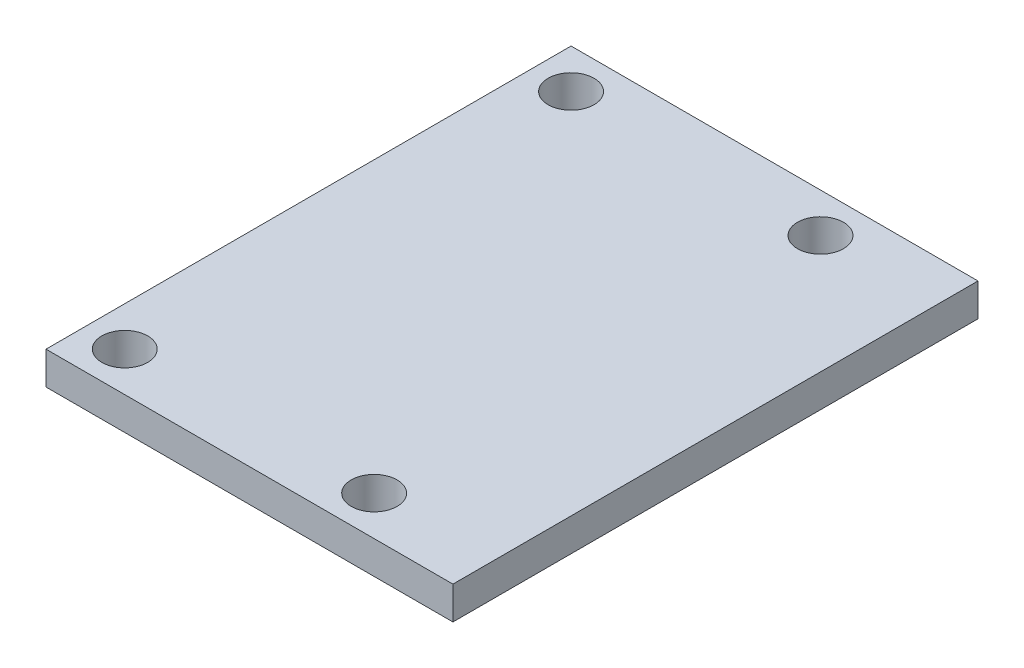
ISO-10303-21;
HEADER;
FILE_DESCRIPTION(('STEP AP214'),'2;1');
FILE_NAME('part.step','',(''),(''),'','','');
FILE_SCHEMA(('AUTOMOTIVE_DESIGN { 1 0 10303 214 1 1 1 1 }'));
ENDSEC;
DATA;
#1=APPLICATION_CONTEXT('core data for automotive mechanical design processes');
#2=APPLICATION_PROTOCOL_DEFINITION('international standard','automotive_design',2000,#1);
#3=PRODUCT_CONTEXT('',#1,'mechanical');
#4=PRODUCT('Part','Part','',(#3));
#5=PRODUCT_RELATED_PRODUCT_CATEGORY('part','',(#4));
#6=PRODUCT_DEFINITION_FORMATION('','',#4);
#7=PRODUCT_DEFINITION_CONTEXT('part definition',#1,'design');
#8=PRODUCT_DEFINITION('design','',#6,#7);
#9=PRODUCT_DEFINITION_SHAPE('','',#8);
#10=(LENGTH_UNIT() NAMED_UNIT(*) SI_UNIT(.MILLI.,.METRE.));
#11=(NAMED_UNIT(*) PLANE_ANGLE_UNIT() SI_UNIT($,.RADIAN.));
#12=(NAMED_UNIT(*) SI_UNIT($,.STERADIAN.) SOLID_ANGLE_UNIT());
#13=UNCERTAINTY_MEASURE_WITH_UNIT(LENGTH_MEASURE(1.E-05),#10,'distance_accuracy_value','');
#14=(GEOMETRIC_REPRESENTATION_CONTEXT(3) GLOBAL_UNCERTAINTY_ASSIGNED_CONTEXT((#13)) GLOBAL_UNIT_ASSIGNED_CONTEXT((#10,
#11,#12)) REPRESENTATION_CONTEXT('',''));
#15=CARTESIAN_POINT('',(0.,0.,0.));
#16=DIRECTION('',(0.,0.,1.));
#17=DIRECTION('',(1.,0.,0.));
#18=AXIS2_PLACEMENT_3D('',#15,#16,#17);
#19=CARTESIAN_POINT('',(-31.,0.,40.));
#20=DIRECTION('',(1.,0.,0.));
#21=DIRECTION('',(0.,1.,0.));
#22=AXIS2_PLACEMENT_3D('',#19,#20,#21);
#23=PLANE('',#22);
#24=DIRECTION('',(0.,-1.,0.));
#25=VECTOR('',#24,1.);
#26=CARTESIAN_POINT('',(-31.,0.,0.));
#27=LINE('',#26,#25);
#28=CARTESIAN_POINT('',(-31.,2.5,0.));
#29=VERTEX_POINT('',#28);
#30=CARTESIAN_POINT('',(-31.,0.,0.));
#31=VERTEX_POINT('',#30);
#32=EDGE_CURVE('E96',#29,#31,#27,.T.);
#33=ORIENTED_EDGE('',*,*,#32,.T.);
#34=DIRECTION('',(0.,0.,-1.));
#35=VECTOR('',#34,1.);
#36=CARTESIAN_POINT('',(-31.,0.,40.));
#37=LINE('',#36,#35);
#38=CARTESIAN_POINT('',(-31.,0.,40.));
#39=VERTEX_POINT('',#38);
#40=EDGE_CURVE('E11',#39,#31,#37,.T.);
#41=ORIENTED_EDGE('',*,*,#40,.F.);
#42=DIRECTION('',(0.,-1.,0.));
#43=VECTOR('',#42,1.);
#44=CARTESIAN_POINT('',(-31.,0.,40.));
#45=LINE('',#44,#43);
#46=CARTESIAN_POINT('',(-31.,2.5,40.));
#47=VERTEX_POINT('',#46);
#48=EDGE_CURVE('E82',#47,#39,#45,.T.);
#49=ORIENTED_EDGE('',*,*,#48,.F.);
#50=DIRECTION('',(0.,0.,-1.));
#51=VECTOR('',#50,1.);
#52=CARTESIAN_POINT('',(-31.,2.5,40.));
#53=LINE('',#52,#51);
#54=EDGE_CURVE('E92',#47,#29,#53,.T.);
#55=ORIENTED_EDGE('',*,*,#54,.T.);
#56=EDGE_LOOP('',(#33,#41,#49,#55));
#57=FACE_BOUND('',#56,.T.);
#58=ADVANCED_FACE('F32',(#57),#23,.F.);
#59=CARTESIAN_POINT('',(0.,0.,40.));
#60=DIRECTION('',(0.,1.,0.));
#61=DIRECTION('',(-1.,0.,0.));
#62=AXIS2_PLACEMENT_3D('',#59,#60,#61);
#63=PLANE('',#62);
#64=CARTESIAN_POINT('',(-9.,0.,37.));
#65=DIRECTION('',(0.,1.,0.));
#66=DIRECTION('',(-1.,0.,0.));
#67=AXIS2_PLACEMENT_3D('',#64,#65,#66);
#68=CIRCLE('',#67,1.75);
#69=CARTESIAN_POINT('',(-10.75,0.,37.));
#70=VERTEX_POINT('',#69);
#71=EDGE_CURVE('E125',#70,#70,#68,.F.);
#72=ORIENTED_EDGE('',*,*,#71,.F.);
#73=EDGE_LOOP('',(#72));
#74=FACE_BOUND('',#73,.T.);
#75=CARTESIAN_POINT('',(-28.,0.,37.));
#76=DIRECTION('',(0.,1.,0.));
#77=DIRECTION('',(-1.,0.,0.));
#78=AXIS2_PLACEMENT_3D('',#75,#76,#77);
#79=CIRCLE('',#78,1.75);
#80=CARTESIAN_POINT('',(-29.75,0.,37.));
#81=VERTEX_POINT('',#80);
#82=EDGE_CURVE('E119',#81,#81,#79,.F.);
#83=ORIENTED_EDGE('',*,*,#82,.F.);
#84=EDGE_LOOP('',(#83));
#85=FACE_BOUND('',#84,.T.);
#86=CARTESIAN_POINT('',(-28.,0.,3.));
#87=DIRECTION('',(0.,1.,0.));
#88=DIRECTION('',(-1.,0.,0.));
#89=AXIS2_PLACEMENT_3D('',#86,#87,#88);
#90=CIRCLE('',#89,1.75);
#91=CARTESIAN_POINT('',(-29.75,0.,3.));
#92=VERTEX_POINT('',#91);
#93=EDGE_CURVE('E113',#92,#92,#90,.F.);
#94=ORIENTED_EDGE('',*,*,#93,.F.);
#95=EDGE_LOOP('',(#94));
#96=FACE_BOUND('',#95,.T.);
#97=CARTESIAN_POINT('',(-9.,0.,3.));
#98=DIRECTION('',(0.,1.,0.));
#99=DIRECTION('',(-1.,0.,0.));
#100=AXIS2_PLACEMENT_3D('',#97,#98,#99);
#101=CIRCLE('',#100,1.75);
#102=CARTESIAN_POINT('',(-10.75,0.,3.));
#103=VERTEX_POINT('',#102);
#104=EDGE_CURVE('E99',#103,#103,#101,.F.);
#105=ORIENTED_EDGE('',*,*,#104,.F.);
#106=EDGE_LOOP('',(#105));
#107=FACE_BOUND('',#106,.T.);
#108=DIRECTION('',(1.,0.,0.));
#109=VECTOR('',#108,1.);
#110=CARTESIAN_POINT('',(0.,0.,0.));
#111=LINE('',#110,#109);
#112=CARTESIAN_POINT('',(0.,0.,0.));
#113=VERTEX_POINT('',#112);
#114=EDGE_CURVE('E87',#31,#113,#111,.T.);
#115=ORIENTED_EDGE('',*,*,#114,.T.);
#116=DIRECTION('',(0.,0.,-1.));
#117=VECTOR('',#116,1.);
#118=CARTESIAN_POINT('',(0.,0.,40.));
#119=LINE('',#118,#117);
#120=CARTESIAN_POINT('',(0.,0.,40.));
#121=VERTEX_POINT('',#120);
#122=EDGE_CURVE('E40',#121,#113,#119,.T.);
#123=ORIENTED_EDGE('',*,*,#122,.F.);
#124=DIRECTION('',(1.,0.,0.));
#125=VECTOR('',#124,1.);
#126=CARTESIAN_POINT('',(0.,0.,40.));
#127=LINE('',#126,#125);
#128=EDGE_CURVE('E76',#39,#121,#127,.T.);
#129=ORIENTED_EDGE('',*,*,#128,.F.);
#130=ORIENTED_EDGE('',*,*,#40,.T.);
#131=EDGE_LOOP('',(#115,#123,#129,#130));
#132=FACE_BOUND('',#131,.T.);
#133=ADVANCED_FACE('F86',(#74,#85,#96,#107,#132),#63,.F.);
#134=CARTESIAN_POINT('',(0.,2.5,40.));
#135=DIRECTION('',(-1.,0.,0.));
#136=DIRECTION('',(0.,0.,1.));
#137=AXIS2_PLACEMENT_3D('',#134,#135,#136);
#138=PLANE('',#137);
#139=DIRECTION('',(0.,1.,0.));
#140=VECTOR('',#139,1.);
#141=CARTESIAN_POINT('',(0.,2.5,0.));
#142=LINE('',#141,#140);
#143=CARTESIAN_POINT('',(0.,2.5,0.));
#144=VERTEX_POINT('',#143);
#145=EDGE_CURVE('E101',#113,#144,#142,.T.);
#146=ORIENTED_EDGE('',*,*,#145,.T.);
#147=DIRECTION('',(0.,0.,-1.));
#148=VECTOR('',#147,1.);
#149=CARTESIAN_POINT('',(0.,2.5,40.));
#150=LINE('',#149,#148);
#151=CARTESIAN_POINT('',(0.,2.5,40.));
#152=VERTEX_POINT('',#151);
#153=EDGE_CURVE('E89',#152,#144,#150,.T.);
#154=ORIENTED_EDGE('',*,*,#153,.F.);
#155=DIRECTION('',(0.,1.,0.));
#156=VECTOR('',#155,1.);
#157=CARTESIAN_POINT('',(0.,2.5,40.));
#158=LINE('',#157,#156);
#159=EDGE_CURVE('E79',#121,#152,#158,.T.);
#160=ORIENTED_EDGE('',*,*,#159,.F.);
#161=ORIENTED_EDGE('',*,*,#122,.T.);
#162=EDGE_LOOP('',(#146,#154,#160,#161));
#163=FACE_BOUND('',#162,.T.);
#164=ADVANCED_FACE('F90',(#163),#138,.F.);
#165=CARTESIAN_POINT('',(-6.,2.5,40.));
#166=DIRECTION('',(0.,-1.,0.));
#167=DIRECTION('',(1.,0.,0.));
#168=AXIS2_PLACEMENT_3D('',#165,#166,#167);
#169=PLANE('',#168);
#170=CARTESIAN_POINT('',(-9.,2.5,37.));
#171=DIRECTION('',(0.,1.,0.));
#172=DIRECTION('',(-1.,0.,0.));
#173=AXIS2_PLACEMENT_3D('',#170,#171,#172);
#174=CIRCLE('',#173,1.75);
#175=CARTESIAN_POINT('',(-10.75,2.5,37.));
#176=VERTEX_POINT('',#175);
#177=EDGE_CURVE('E128',#176,#176,#174,.T.);
#178=ORIENTED_EDGE('',*,*,#177,.F.);
#179=EDGE_LOOP('',(#178));
#180=FACE_BOUND('',#179,.T.);
#181=CARTESIAN_POINT('',(-28.,2.5,37.));
#182=DIRECTION('',(0.,1.,0.));
#183=DIRECTION('',(-1.,0.,0.));
#184=AXIS2_PLACEMENT_3D('',#181,#182,#183);
#185=CIRCLE('',#184,1.75);
#186=CARTESIAN_POINT('',(-29.75,2.5,37.));
#187=VERTEX_POINT('',#186);
#188=EDGE_CURVE('E122',#187,#187,#185,.T.);
#189=ORIENTED_EDGE('',*,*,#188,.F.);
#190=EDGE_LOOP('',(#189));
#191=FACE_BOUND('',#190,.T.);
#192=CARTESIAN_POINT('',(-28.,2.5,3.));
#193=DIRECTION('',(0.,1.,0.));
#194=DIRECTION('',(-1.,0.,0.));
#195=AXIS2_PLACEMENT_3D('',#192,#193,#194);
#196=CIRCLE('',#195,1.75);
#197=CARTESIAN_POINT('',(-29.75,2.5,3.));
#198=VERTEX_POINT('',#197);
#199=EDGE_CURVE('E116',#198,#198,#196,.T.);
#200=ORIENTED_EDGE('',*,*,#199,.F.);
#201=EDGE_LOOP('',(#200));
#202=FACE_BOUND('',#201,.T.);
#203=CARTESIAN_POINT('',(-9.,2.5,3.));
#204=DIRECTION('',(0.,1.,0.));
#205=DIRECTION('',(-1.,0.,0.));
#206=AXIS2_PLACEMENT_3D('',#203,#204,#205);
#207=CIRCLE('',#206,1.75);
#208=CARTESIAN_POINT('',(-10.75,2.5,3.));
#209=VERTEX_POINT('',#208);
#210=EDGE_CURVE('E110',#209,#209,#207,.T.);
#211=ORIENTED_EDGE('',*,*,#210,.F.);
#212=EDGE_LOOP('',(#211));
#213=FACE_BOUND('',#212,.T.);
#214=DIRECTION('',(-1.,0.,0.));
#215=VECTOR('',#214,1.);
#216=CARTESIAN_POINT('',(-6.,2.5,0.));
#217=LINE('',#216,#215);
#218=EDGE_CURVE('E65',#144,#29,#217,.T.);
#219=ORIENTED_EDGE('',*,*,#218,.T.);
#220=ORIENTED_EDGE('',*,*,#54,.F.);
#221=DIRECTION('',(-1.,0.,0.));
#222=VECTOR('',#221,1.);
#223=CARTESIAN_POINT('',(-6.,2.5,40.));
#224=LINE('',#223,#222);
#225=EDGE_CURVE('E48',#152,#47,#224,.T.);
#226=ORIENTED_EDGE('',*,*,#225,.F.);
#227=ORIENTED_EDGE('',*,*,#153,.T.);
#228=EDGE_LOOP('',(#219,#220,#226,#227));
#229=FACE_BOUND('',#228,.T.);
#230=ADVANCED_FACE('F105',(#180,#191,#202,#213,#229),#169,.F.);
#231=CARTESIAN_POINT('',(0.,0.,40.));
#232=DIRECTION('',(0.,0.,1.));
#233=DIRECTION('',(1.,0.,0.));
#234=AXIS2_PLACEMENT_3D('',#231,#232,#233);
#235=PLANE('',#234);
#236=ORIENTED_EDGE('',*,*,#48,.T.);
#237=ORIENTED_EDGE('',*,*,#128,.T.);
#238=ORIENTED_EDGE('',*,*,#159,.T.);
#239=ORIENTED_EDGE('',*,*,#225,.T.);
#240=EDGE_LOOP('',(#236,#237,#238,#239));
#241=FACE_BOUND('',#240,.T.);
#242=ADVANCED_FACE('F77',(#241),#235,.T.);
#243=CARTESIAN_POINT('',(0.,0.,0.));
#244=DIRECTION('',(0.,0.,1.));
#245=DIRECTION('',(1.,0.,0.));
#246=AXIS2_PLACEMENT_3D('',#243,#244,#245);
#247=PLANE('',#246);
#248=ORIENTED_EDGE('',*,*,#32,.F.);
#249=ORIENTED_EDGE('',*,*,#218,.F.);
#250=ORIENTED_EDGE('',*,*,#145,.F.);
#251=ORIENTED_EDGE('',*,*,#114,.F.);
#252=EDGE_LOOP('',(#248,#249,#250,#251));
#253=FACE_BOUND('',#252,.T.);
#254=ADVANCED_FACE('F148',(#253),#247,.F.);
#255=CARTESIAN_POINT('',(-9.,-0.0010000000000049,3.));
#256=DIRECTION('',(0.,1.,0.));
#257=DIRECTION('',(-1.,0.,0.));
#258=AXIS2_PLACEMENT_3D('',#255,#256,#257);
#259=CYLINDRICAL_SURFACE('',#258,1.75);
#260=ORIENTED_EDGE('',*,*,#210,.T.);
#261=EDGE_LOOP('',(#260));
#262=FACE_BOUND('',#261,.T.);
#263=ORIENTED_EDGE('',*,*,#104,.T.);
#264=EDGE_LOOP('',(#263));
#265=FACE_BOUND('',#264,.T.);
#266=ADVANCED_FACE('F144',(#262,#265),#259,.F.);
#267=CARTESIAN_POINT('',(-28.,-0.00100000000000751,3.));
#268=DIRECTION('',(0.,1.,0.));
#269=DIRECTION('',(-1.,0.,0.));
#270=AXIS2_PLACEMENT_3D('',#267,#268,#269);
#271=CYLINDRICAL_SURFACE('',#270,1.75);
#272=ORIENTED_EDGE('',*,*,#199,.T.);
#273=EDGE_LOOP('',(#272));
#274=FACE_BOUND('',#273,.T.);
#275=ORIENTED_EDGE('',*,*,#93,.T.);
#276=EDGE_LOOP('',(#275));
#277=FACE_BOUND('',#276,.T.);
#278=ADVANCED_FACE('F147',(#274,#277),#271,.F.);
#279=CARTESIAN_POINT('',(-28.,-0.00100000000000751,37.));
#280=DIRECTION('',(0.,1.,0.));
#281=DIRECTION('',(-1.,0.,0.));
#282=AXIS2_PLACEMENT_3D('',#279,#280,#281);
#283=CYLINDRICAL_SURFACE('',#282,1.75);
#284=ORIENTED_EDGE('',*,*,#188,.T.);
#285=EDGE_LOOP('',(#284));
#286=FACE_BOUND('',#285,.T.);
#287=ORIENTED_EDGE('',*,*,#82,.T.);
#288=EDGE_LOOP('',(#287));
#289=FACE_BOUND('',#288,.T.);
#290=ADVANCED_FACE('F168',(#286,#289),#283,.F.);
#291=CARTESIAN_POINT('',(-9.,-0.0010000000000049,37.));
#292=DIRECTION('',(0.,1.,0.));
#293=DIRECTION('',(-1.,0.,0.));
#294=AXIS2_PLACEMENT_3D('',#291,#292,#293);
#295=CYLINDRICAL_SURFACE('',#294,1.75);
#296=ORIENTED_EDGE('',*,*,#177,.T.);
#297=EDGE_LOOP('',(#296));
#298=FACE_BOUND('',#297,.T.);
#299=ORIENTED_EDGE('',*,*,#71,.T.);
#300=EDGE_LOOP('',(#299));
#301=FACE_BOUND('',#300,.T.);
#302=ADVANCED_FACE('F132',(#298,#301),#295,.F.);
#303=CLOSED_SHELL('',(#58,#133,#164,#230,#242,#254,#266,#278,#290,#302));
#304=MANIFOLD_SOLID_BREP('B2',#303);
#305=ADVANCED_BREP_SHAPE_REPRESENTATION('',(#18,#304),#14);
#306=SHAPE_DEFINITION_REPRESENTATION(#9,#305);
ENDSEC;
END-ISO-10303-21;
